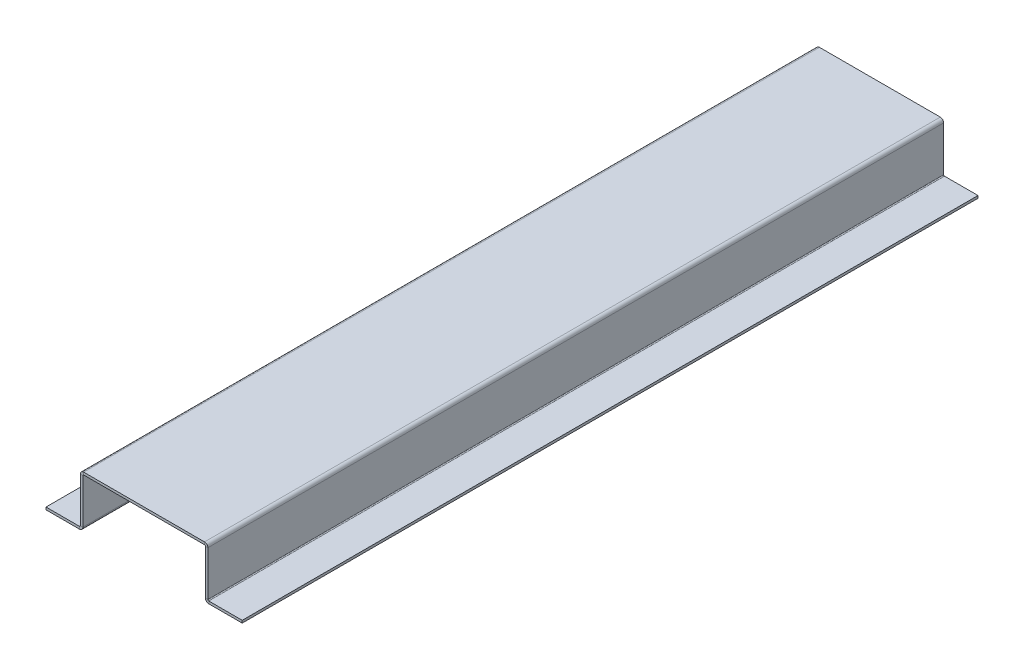
ISO-10303-21;
HEADER;
FILE_DESCRIPTION(('STEP AP214'),'2;1');
FILE_NAME('part.step','',(''),(''),'','','');
FILE_SCHEMA(('AUTOMOTIVE_DESIGN { 1 0 10303 214 1 1 1 1 }'));
ENDSEC;
DATA;
#1=APPLICATION_CONTEXT('core data for automotive mechanical design processes');
#2=APPLICATION_PROTOCOL_DEFINITION('international standard','automotive_design',2000,#1);
#3=PRODUCT_CONTEXT('',#1,'mechanical');
#4=PRODUCT('Part','Part','',(#3));
#5=PRODUCT_RELATED_PRODUCT_CATEGORY('part','',(#4));
#6=PRODUCT_DEFINITION_FORMATION('','',#4);
#7=PRODUCT_DEFINITION_CONTEXT('part definition',#1,'design');
#8=PRODUCT_DEFINITION('design','',#6,#7);
#9=PRODUCT_DEFINITION_SHAPE('','',#8);
#10=(LENGTH_UNIT() NAMED_UNIT(*) SI_UNIT(.MILLI.,.METRE.));
#11=(NAMED_UNIT(*) PLANE_ANGLE_UNIT() SI_UNIT($,.RADIAN.));
#12=(NAMED_UNIT(*) SI_UNIT($,.STERADIAN.) SOLID_ANGLE_UNIT());
#13=UNCERTAINTY_MEASURE_WITH_UNIT(LENGTH_MEASURE(1.E-05),#10,'distance_accuracy_value','');
#14=(GEOMETRIC_REPRESENTATION_CONTEXT(3) GLOBAL_UNCERTAINTY_ASSIGNED_CONTEXT((#13)) GLOBAL_UNIT_ASSIGNED_CONTEXT((#10,
#11,#12)) REPRESENTATION_CONTEXT('',''));
#15=CARTESIAN_POINT('',(0.,0.,0.));
#16=DIRECTION('',(0.,0.,1.));
#17=DIRECTION('',(1.,0.,0.));
#18=AXIS2_PLACEMENT_3D('',#15,#16,#17);
#19=CARTESIAN_POINT('',(52.7366,-40.,-300.));
#20=DIRECTION('',(0.,0.,-1.));
#21=DIRECTION('',(-1.,0.,0.));
#22=AXIS2_PLACEMENT_3D('',#19,#20,#21);
#23=PLANE('',#22);
#24=DIRECTION('',(0.,1.,0.));
#25=VECTOR('',#24,1.);
#26=CARTESIAN_POINT('',(52.7366,-40.,-300.));
#27=LINE('',#26,#25);
#28=CARTESIAN_POINT('',(52.7366,-40.,-300.));
#29=VERTEX_POINT('',#28);
#30=CARTESIAN_POINT('',(52.7366,-38.,-300.));
#31=VERTEX_POINT('',#30);
#32=EDGE_CURVE('E11',#29,#31,#27,.T.);
#33=ORIENTED_EDGE('',*,*,#32,.F.);
#34=CARTESIAN_POINT('',(52.7366,-37.2634,-300.));
#35=DIRECTION('',(0.,0.,1.));
#36=DIRECTION('',(1.,0.,0.));
#37=AXIS2_PLACEMENT_3D('',#34,#35,#36);
#38=CIRCLE('',#37,2.7366);
#39=CARTESIAN_POINT('',(50.,-37.2634,-300.));
#40=VERTEX_POINT('',#39);
#41=EDGE_CURVE('E374',#29,#40,#38,.F.);
#42=ORIENTED_EDGE('',*,*,#41,.T.);
#43=DIRECTION('',(-1.,0.,0.));
#44=VECTOR('',#43,1.);
#45=CARTESIAN_POINT('',(52.,-37.2634,-300.));
#46=LINE('',#45,#44);
#47=CARTESIAN_POINT('',(52.,-37.2634,-300.));
#48=VERTEX_POINT('',#47);
#49=EDGE_CURVE('E51',#48,#40,#46,.T.);
#50=ORIENTED_EDGE('',*,*,#49,.F.);
#51=CARTESIAN_POINT('',(52.7366,-37.2634,-300.));
#52=DIRECTION('',(0.,0.,1.));
#53=DIRECTION('',(1.,0.,0.));
#54=AXIS2_PLACEMENT_3D('',#51,#52,#53);
#55=CIRCLE('',#54,0.7366);
#56=EDGE_CURVE('E399',#31,#48,#55,.F.);
#57=ORIENTED_EDGE('',*,*,#56,.F.);
#58=EDGE_LOOP('',(#33,#42,#50,#57));
#59=FACE_BOUND('',#58,.T.);
#60=ADVANCED_FACE('F43',(#59),#23,.T.);
#61=CARTESIAN_POINT('',(52.,-37.2634,-300.));
#62=DIRECTION('',(0.,0.,-1.));
#63=DIRECTION('',(-1.,0.,0.));
#64=AXIS2_PLACEMENT_3D('',#61,#62,#63);
#65=PLANE('',#64);
#66=DIRECTION('',(-1.,0.,0.));
#67=VECTOR('',#66,1.);
#68=CARTESIAN_POINT('',(50.,-40.,-300.));
#69=LINE('',#68,#67);
#70=CARTESIAN_POINT('',(80.,-40.,-300.));
#71=VERTEX_POINT('',#70);
#72=EDGE_CURVE('E378',#71,#29,#69,.T.);
#73=ORIENTED_EDGE('',*,*,#72,.T.);
#74=ORIENTED_EDGE('',*,*,#32,.T.);
#75=DIRECTION('',(-1.,0.,0.));
#76=VECTOR('',#75,1.);
#77=CARTESIAN_POINT('',(50.,-38.,-300.));
#78=LINE('',#77,#76);
#79=CARTESIAN_POINT('',(80.,-38.,-300.));
#80=VERTEX_POINT('',#79);
#81=EDGE_CURVE('E396',#80,#31,#78,.T.);
#82=ORIENTED_EDGE('',*,*,#81,.F.);
#83=DIRECTION('',(0.,-1.,0.));
#84=VECTOR('',#83,1.);
#85=CARTESIAN_POINT('',(80.,-38.,-300.));
#86=LINE('',#85,#84);
#87=EDGE_CURVE('E394',#80,#71,#86,.T.);
#88=ORIENTED_EDGE('',*,*,#87,.T.);
#89=EDGE_LOOP('',(#73,#74,#82,#88));
#90=FACE_BOUND('',#89,.T.);
#91=ADVANCED_FACE('F424',(#90),#65,.T.);
#92=CARTESIAN_POINT('',(50.,-37.2634,300.));
#93=DIRECTION('',(0.,0.,1.));
#94=DIRECTION('',(1.,0.,0.));
#95=AXIS2_PLACEMENT_3D('',#92,#93,#94);
#96=PLANE('',#95);
#97=DIRECTION('',(1.,0.,0.));
#98=VECTOR('',#97,1.);
#99=CARTESIAN_POINT('',(50.,-37.2634,300.));
#100=LINE('',#99,#98);
#101=CARTESIAN_POINT('',(50.,-37.2634,300.));
#102=VERTEX_POINT('',#101);
#103=CARTESIAN_POINT('',(52.,-37.2634,300.));
#104=VERTEX_POINT('',#103);
#105=EDGE_CURVE('E358',#102,#104,#100,.T.);
#106=ORIENTED_EDGE('',*,*,#105,.F.);
#107=CARTESIAN_POINT('',(52.7366,-37.2634,300.));
#108=DIRECTION('',(0.,0.,1.));
#109=DIRECTION('',(1.,0.,0.));
#110=AXIS2_PLACEMENT_3D('',#107,#108,#109);
#111=CIRCLE('',#110,2.7366);
#112=CARTESIAN_POINT('',(52.7366,-40.,300.));
#113=VERTEX_POINT('',#112);
#114=EDGE_CURVE('E262',#113,#102,#111,.F.);
#115=ORIENTED_EDGE('',*,*,#114,.F.);
#116=DIRECTION('',(0.,-1.,0.));
#117=VECTOR('',#116,1.);
#118=CARTESIAN_POINT('',(52.7366,-38.,300.));
#119=LINE('',#118,#117);
#120=CARTESIAN_POINT('',(52.7366,-38.,300.));
#121=VERTEX_POINT('',#120);
#122=EDGE_CURVE('E356',#121,#113,#119,.T.);
#123=ORIENTED_EDGE('',*,*,#122,.F.);
#124=CARTESIAN_POINT('',(52.7366,-37.2634,300.));
#125=DIRECTION('',(0.,0.,1.));
#126=DIRECTION('',(1.,0.,0.));
#127=AXIS2_PLACEMENT_3D('',#124,#125,#126);
#128=CIRCLE('',#127,0.7366);
#129=EDGE_CURVE('E273',#121,#104,#128,.F.);
#130=ORIENTED_EDGE('',*,*,#129,.T.);
#131=EDGE_LOOP('',(#106,#115,#123,#130));
#132=FACE_BOUND('',#131,.T.);
#133=ADVANCED_FACE('F432',(#132),#96,.T.);
#134=CARTESIAN_POINT('',(52.7366,-38.,300.));
#135=DIRECTION('',(0.,0.,1.));
#136=DIRECTION('',(1.,0.,0.));
#137=AXIS2_PLACEMENT_3D('',#134,#135,#136);
#138=PLANE('',#137);
#139=DIRECTION('',(0.,1.,0.));
#140=VECTOR('',#139,1.);
#141=CARTESIAN_POINT('',(50.,0.,300.));
#142=LINE('',#141,#140);
#143=CARTESIAN_POINT('',(50.,-0.736599999999982,300.));
#144=VERTEX_POINT('',#143);
#145=EDGE_CURVE('E259',#102,#144,#142,.T.);
#146=ORIENTED_EDGE('',*,*,#145,.F.);
#147=ORIENTED_EDGE('',*,*,#105,.T.);
#148=DIRECTION('',(0.,1.,0.));
#149=VECTOR('',#148,1.);
#150=CARTESIAN_POINT('',(52.,0.,300.));
#151=LINE('',#150,#149);
#152=CARTESIAN_POINT('',(52.,-0.736599999999981,300.));
#153=VERTEX_POINT('',#152);
#154=EDGE_CURVE('E276',#104,#153,#151,.T.);
#155=ORIENTED_EDGE('',*,*,#154,.T.);
#156=DIRECTION('',(-1.,0.,0.));
#157=VECTOR('',#156,1.);
#158=CARTESIAN_POINT('',(52.,-0.736599999999981,300.));
#159=LINE('',#158,#157);
#160=EDGE_CURVE('E348',#153,#144,#159,.T.);
#161=ORIENTED_EDGE('',*,*,#160,.T.);
#162=EDGE_LOOP('',(#146,#147,#155,#161));
#163=FACE_BOUND('',#162,.T.);
#164=ADVANCED_FACE('F434',(#163),#138,.T.);
#165=CARTESIAN_POINT('',(50.,-0.736599999999982,-300.));
#166=DIRECTION('',(0.,0.,-1.));
#167=DIRECTION('',(-1.,0.,0.));
#168=AXIS2_PLACEMENT_3D('',#165,#166,#167);
#169=PLANE('',#168);
#170=DIRECTION('',(1.,0.,0.));
#171=VECTOR('',#170,1.);
#172=CARTESIAN_POINT('',(50.,-0.736599999999982,-300.));
#173=LINE('',#172,#171);
#174=CARTESIAN_POINT('',(50.,-0.736599999999982,-300.));
#175=VERTEX_POINT('',#174);
#176=CARTESIAN_POINT('',(52.,-0.736599999999981,-300.));
#177=VERTEX_POINT('',#176);
#178=EDGE_CURVE('E354',#175,#177,#173,.T.);
#179=ORIENTED_EDGE('',*,*,#178,.F.);
#180=CARTESIAN_POINT('',(49.2634,-0.736599999999982,-300.));
#181=DIRECTION('',(0.,0.,-1.));
#182=DIRECTION('',(-1.,0.,0.));
#183=AXIS2_PLACEMENT_3D('',#180,#181,#182);
#184=CIRCLE('',#183,0.7366);
#185=CARTESIAN_POINT('',(49.2634,0.,-300.));
#186=VERTEX_POINT('',#185);
#187=EDGE_CURVE('E386',#175,#186,#184,.F.);
#188=ORIENTED_EDGE('',*,*,#187,.T.);
#189=DIRECTION('',(0.,-1.,0.));
#190=VECTOR('',#189,1.);
#191=CARTESIAN_POINT('',(49.2634,2.00000000000002,-300.));
#192=LINE('',#191,#190);
#193=CARTESIAN_POINT('',(49.2634,2.00000000000002,-300.));
#194=VERTEX_POINT('',#193);
#195=EDGE_CURVE('E352',#194,#186,#192,.T.);
#196=ORIENTED_EDGE('',*,*,#195,.F.);
#197=CARTESIAN_POINT('',(49.2634,-0.736599999999982,-300.));
#198=DIRECTION('',(0.,0.,1.));
#199=DIRECTION('',(1.,0.,0.));
#200=AXIS2_PLACEMENT_3D('',#197,#198,#199);
#201=CIRCLE('',#200,2.7366);
#202=EDGE_CURVE('E230',#177,#194,#201,.T.);
#203=ORIENTED_EDGE('',*,*,#202,.F.);
#204=EDGE_LOOP('',(#179,#188,#196,#203));
#205=FACE_BOUND('',#204,.T.);
#206=ADVANCED_FACE('F410',(#205),#169,.T.);
#207=CARTESIAN_POINT('',(49.2634,2.00000000000002,-300.));
#208=DIRECTION('',(0.,0.,-1.));
#209=DIRECTION('',(-1.,0.,0.));
#210=AXIS2_PLACEMENT_3D('',#207,#208,#209);
#211=PLANE('',#210);
#212=DIRECTION('',(0.,1.,0.));
#213=VECTOR('',#212,1.);
#214=CARTESIAN_POINT('',(50.,0.,-300.));
#215=LINE('',#214,#213);
#216=EDGE_CURVE('E365',#40,#175,#215,.T.);
#217=ORIENTED_EDGE('',*,*,#216,.T.);
#218=ORIENTED_EDGE('',*,*,#178,.T.);
#219=DIRECTION('',(0.,1.,0.));
#220=VECTOR('',#219,1.);
#221=CARTESIAN_POINT('',(52.,0.,-300.));
#222=LINE('',#221,#220);
#223=EDGE_CURVE('E368',#48,#177,#222,.T.);
#224=ORIENTED_EDGE('',*,*,#223,.F.);
#225=ORIENTED_EDGE('',*,*,#49,.T.);
#226=EDGE_LOOP('',(#217,#218,#224,#225));
#227=FACE_BOUND('',#226,.T.);
#228=ADVANCED_FACE('F363',(#227),#211,.T.);
#229=CARTESIAN_POINT('',(49.2634,0.,300.));
#230=DIRECTION('',(0.,0.,1.));
#231=DIRECTION('',(1.,0.,0.));
#232=AXIS2_PLACEMENT_3D('',#229,#230,#231);
#233=PLANE('',#232);
#234=DIRECTION('',(0.,1.,0.));
#235=VECTOR('',#234,1.);
#236=CARTESIAN_POINT('',(49.2634,0.,300.));
#237=LINE('',#236,#235);
#238=CARTESIAN_POINT('',(49.2634,0.,300.));
#239=VERTEX_POINT('',#238);
#240=CARTESIAN_POINT('',(49.2634,2.00000000000002,300.));
#241=VERTEX_POINT('',#240);
#242=EDGE_CURVE('E350',#239,#241,#237,.T.);
#243=ORIENTED_EDGE('',*,*,#242,.F.);
#244=CARTESIAN_POINT('',(49.2634,-0.736599999999982,300.));
#245=DIRECTION('',(0.,0.,-1.));
#246=DIRECTION('',(-1.,0.,0.));
#247=AXIS2_PLACEMENT_3D('',#244,#245,#246);
#248=CIRCLE('',#247,0.7366);
#249=EDGE_CURVE('E256',#144,#239,#248,.F.);
#250=ORIENTED_EDGE('',*,*,#249,.F.);
#251=ORIENTED_EDGE('',*,*,#160,.F.);
#252=CARTESIAN_POINT('',(49.2634,-0.736599999999982,300.));
#253=DIRECTION('',(0.,0.,1.));
#254=DIRECTION('',(1.,0.,0.));
#255=AXIS2_PLACEMENT_3D('',#252,#253,#254);
#256=CIRCLE('',#255,2.7366);
#257=EDGE_CURVE('E279',#153,#241,#256,.T.);
#258=ORIENTED_EDGE('',*,*,#257,.T.);
#259=EDGE_LOOP('',(#243,#250,#251,#258));
#260=FACE_BOUND('',#259,.T.);
#261=ADVANCED_FACE('F440',(#260),#233,.T.);
#262=CARTESIAN_POINT('',(52.,-0.736599999999981,300.));
#263=DIRECTION('',(0.,0.,1.));
#264=DIRECTION('',(1.,0.,0.));
#265=AXIS2_PLACEMENT_3D('',#262,#263,#264);
#266=PLANE('',#265);
#267=DIRECTION('',(-1.,0.,0.));
#268=VECTOR('',#267,1.);
#269=CARTESIAN_POINT('',(-50.,0.,300.));
#270=LINE('',#269,#268);
#271=CARTESIAN_POINT('',(-49.2634,0.,300.));
#272=VERTEX_POINT('',#271);
#273=EDGE_CURVE('E253',#239,#272,#270,.T.);
#274=ORIENTED_EDGE('',*,*,#273,.F.);
#275=ORIENTED_EDGE('',*,*,#242,.T.);
#276=DIRECTION('',(-1.,0.,0.));
#277=VECTOR('',#276,1.);
#278=CARTESIAN_POINT('',(-50.,2.,300.));
#279=LINE('',#278,#277);
#280=CARTESIAN_POINT('',(-49.2634,2.,300.));
#281=VERTEX_POINT('',#280);
#282=EDGE_CURVE('E282',#241,#281,#279,.T.);
#283=ORIENTED_EDGE('',*,*,#282,.T.);
#284=DIRECTION('',(0.,-1.,0.));
#285=VECTOR('',#284,1.);
#286=CARTESIAN_POINT('',(-49.2634,2.,300.));
#287=LINE('',#286,#285);
#288=EDGE_CURVE('E344',#281,#272,#287,.T.);
#289=ORIENTED_EDGE('',*,*,#288,.T.);
#290=EDGE_LOOP('',(#274,#275,#283,#289));
#291=FACE_BOUND('',#290,.T.);
#292=ADVANCED_FACE('F443',(#291),#266,.T.);
#293=CARTESIAN_POINT('',(-49.2634,0.,-300.));
#294=DIRECTION('',(0.,0.,-1.));
#295=DIRECTION('',(-1.,0.,0.));
#296=AXIS2_PLACEMENT_3D('',#293,#294,#295);
#297=PLANE('',#296);
#298=DIRECTION('',(0.,1.,0.));
#299=VECTOR('',#298,1.);
#300=CARTESIAN_POINT('',(-49.2634,0.,-300.));
#301=LINE('',#300,#299);
#302=CARTESIAN_POINT('',(-49.2634,0.,-300.));
#303=VERTEX_POINT('',#302);
#304=CARTESIAN_POINT('',(-49.2634,2.,-300.));
#305=VERTEX_POINT('',#304);
#306=EDGE_CURVE('E202',#303,#305,#301,.T.);
#307=ORIENTED_EDGE('',*,*,#306,.F.);
#308=CARTESIAN_POINT('',(-49.2634,-0.7366,-300.));
#309=DIRECTION('',(0.,0.,-1.));
#310=DIRECTION('',(-1.,0.,0.));
#311=AXIS2_PLACEMENT_3D('',#308,#309,#310);
#312=CIRCLE('',#311,0.7366);
#313=CARTESIAN_POINT('',(-50.,-0.7366,-300.));
#314=VERTEX_POINT('',#313);
#315=EDGE_CURVE('E197',#303,#314,#312,.F.);
#316=ORIENTED_EDGE('',*,*,#315,.T.);
#317=DIRECTION('',(1.,0.,0.));
#318=VECTOR('',#317,1.);
#319=CARTESIAN_POINT('',(-52.,-0.736599999999999,-300.));
#320=LINE('',#319,#318);
#321=CARTESIAN_POINT('',(-52.,-0.736599999999999,-300.));
#322=VERTEX_POINT('',#321);
#323=EDGE_CURVE('E190',#322,#314,#320,.T.);
#324=ORIENTED_EDGE('',*,*,#323,.F.);
#325=CARTESIAN_POINT('',(-49.2634,-0.7366,-300.));
#326=DIRECTION('',(0.,0.,1.));
#327=DIRECTION('',(1.,0.,0.));
#328=AXIS2_PLACEMENT_3D('',#325,#326,#327);
#329=CIRCLE('',#328,2.7366);
#330=EDGE_CURVE('E194',#305,#322,#329,.T.);
#331=ORIENTED_EDGE('',*,*,#330,.F.);
#332=EDGE_LOOP('',(#307,#316,#324,#331));
#333=FACE_BOUND('',#332,.T.);
#334=ADVANCED_FACE('F192',(#333),#297,.T.);
#335=CARTESIAN_POINT('',(-52.,-0.736599999999999,-300.));
#336=DIRECTION('',(0.,0.,-1.));
#337=DIRECTION('',(-1.,0.,0.));
#338=AXIS2_PLACEMENT_3D('',#335,#336,#337);
#339=PLANE('',#338);
#340=DIRECTION('',(-1.,0.,0.));
#341=VECTOR('',#340,1.);
#342=CARTESIAN_POINT('',(-50.,0.,-300.));
#343=LINE('',#342,#341);
#344=EDGE_CURVE('E389',#186,#303,#343,.T.);
#345=ORIENTED_EDGE('',*,*,#344,.T.);
#346=ORIENTED_EDGE('',*,*,#306,.T.);
#347=DIRECTION('',(-1.,0.,0.));
#348=VECTOR('',#347,1.);
#349=CARTESIAN_POINT('',(-50.,2.,-300.));
#350=LINE('',#349,#348);
#351=EDGE_CURVE('E228',#194,#305,#350,.T.);
#352=ORIENTED_EDGE('',*,*,#351,.F.);
#353=ORIENTED_EDGE('',*,*,#195,.T.);
#354=EDGE_LOOP('',(#345,#346,#352,#353));
#355=FACE_BOUND('',#354,.T.);
#356=ADVANCED_FACE('F491',(#355),#339,.T.);
#357=CARTESIAN_POINT('',(-50.,-0.7366,300.));
#358=DIRECTION('',(0.,0.,1.));
#359=DIRECTION('',(1.,0.,0.));
#360=AXIS2_PLACEMENT_3D('',#357,#358,#359);
#361=PLANE('',#360);
#362=DIRECTION('',(-1.,0.,0.));
#363=VECTOR('',#362,1.);
#364=CARTESIAN_POINT('',(-50.,-0.7366,300.));
#365=LINE('',#364,#363);
#366=CARTESIAN_POINT('',(-50.,-0.7366,300.));
#367=VERTEX_POINT('',#366);
#368=CARTESIAN_POINT('',(-52.,-0.736599999999999,300.));
#369=VERTEX_POINT('',#368);
#370=EDGE_CURVE('E203',#367,#369,#365,.T.);
#371=ORIENTED_EDGE('',*,*,#370,.F.);
#372=CARTESIAN_POINT('',(-49.2634,-0.7366,300.));
#373=DIRECTION('',(0.,0.,-1.));
#374=DIRECTION('',(-1.,0.,0.));
#375=AXIS2_PLACEMENT_3D('',#372,#373,#374);
#376=CIRCLE('',#375,0.7366);
#377=EDGE_CURVE('E250',#272,#367,#376,.F.);
#378=ORIENTED_EDGE('',*,*,#377,.F.);
#379=ORIENTED_EDGE('',*,*,#288,.F.);
#380=CARTESIAN_POINT('',(-49.2634,-0.7366,300.));
#381=DIRECTION('',(0.,0.,1.));
#382=DIRECTION('',(1.,0.,0.));
#383=AXIS2_PLACEMENT_3D('',#380,#381,#382);
#384=CIRCLE('',#383,2.7366);
#385=EDGE_CURVE('E285',#281,#369,#384,.T.);
#386=ORIENTED_EDGE('',*,*,#385,.T.);
#387=EDGE_LOOP('',(#371,#378,#379,#386));
#388=FACE_BOUND('',#387,.T.);
#389=ADVANCED_FACE('F452',(#388),#361,.T.);
#390=CARTESIAN_POINT('',(-49.2634,2.,300.));
#391=DIRECTION('',(0.,0.,1.));
#392=DIRECTION('',(1.,0.,0.));
#393=AXIS2_PLACEMENT_3D('',#390,#391,#392);
#394=PLANE('',#393);
#395=DIRECTION('',(0.,-1.,0.));
#396=VECTOR('',#395,1.);
#397=CARTESIAN_POINT('',(-50.,0.,300.));
#398=LINE('',#397,#396);
#399=CARTESIAN_POINT('',(-50.,-37.2634,300.));
#400=VERTEX_POINT('',#399);
#401=EDGE_CURVE('E247',#367,#400,#398,.T.);
#402=ORIENTED_EDGE('',*,*,#401,.F.);
#403=ORIENTED_EDGE('',*,*,#370,.T.);
#404=DIRECTION('',(0.,-1.,0.));
#405=VECTOR('',#404,1.);
#406=CARTESIAN_POINT('',(-52.,0.,300.));
#407=LINE('',#406,#405);
#408=CARTESIAN_POINT('',(-52.,-37.2634,300.));
#409=VERTEX_POINT('',#408);
#410=EDGE_CURVE('E213',#369,#409,#407,.T.);
#411=ORIENTED_EDGE('',*,*,#410,.T.);
#412=DIRECTION('',(1.,0.,0.));
#413=VECTOR('',#412,1.);
#414=CARTESIAN_POINT('',(-52.,-37.2634,300.));
#415=LINE('',#414,#413);
#416=EDGE_CURVE('E124',#409,#400,#415,.T.);
#417=ORIENTED_EDGE('',*,*,#416,.T.);
#418=EDGE_LOOP('',(#402,#403,#411,#417));
#419=FACE_BOUND('',#418,.T.);
#420=ADVANCED_FACE('F455',(#419),#394,.T.);
#421=CARTESIAN_POINT('',(-50.,-37.2634,-300.));
#422=DIRECTION('',(0.,0.,-1.));
#423=DIRECTION('',(-1.,0.,0.));
#424=AXIS2_PLACEMENT_3D('',#421,#422,#423);
#425=PLANE('',#424);
#426=DIRECTION('',(-1.,0.,0.));
#427=VECTOR('',#426,1.);
#428=CARTESIAN_POINT('',(-50.,-37.2634,-300.));
#429=LINE('',#428,#427);
#430=CARTESIAN_POINT('',(-50.,-37.2634,-300.));
#431=VERTEX_POINT('',#430);
#432=CARTESIAN_POINT('',(-52.,-37.2634,-300.));
#433=VERTEX_POINT('',#432);
#434=EDGE_CURVE('E221',#431,#433,#429,.T.);
#435=ORIENTED_EDGE('',*,*,#434,.F.);
#436=CARTESIAN_POINT('',(-52.7366,-37.2634,-300.));
#437=DIRECTION('',(0.,0.,1.));
#438=DIRECTION('',(1.,0.,0.));
#439=AXIS2_PLACEMENT_3D('',#436,#437,#438);
#440=CIRCLE('',#439,2.7366);
#441=CARTESIAN_POINT('',(-52.7366,-40.,-300.));
#442=VERTEX_POINT('',#441);
#443=EDGE_CURVE('E465',#431,#442,#440,.F.);
#444=ORIENTED_EDGE('',*,*,#443,.T.);
#445=DIRECTION('',(0.,-1.,0.));
#446=VECTOR('',#445,1.);
#447=CARTESIAN_POINT('',(-52.7366,-38.,-300.));
#448=LINE('',#447,#446);
#449=CARTESIAN_POINT('',(-52.7366,-38.,-300.));
#450=VERTEX_POINT('',#449);
#451=EDGE_CURVE('E59',#450,#442,#448,.T.);
#452=ORIENTED_EDGE('',*,*,#451,.F.);
#453=CARTESIAN_POINT('',(-52.7366,-37.2634,-300.));
#454=DIRECTION('',(0.,0.,1.));
#455=DIRECTION('',(1.,0.,0.));
#456=AXIS2_PLACEMENT_3D('',#453,#454,#455);
#457=CIRCLE('',#456,0.7366);
#458=EDGE_CURVE('E223',#433,#450,#457,.F.);
#459=ORIENTED_EDGE('',*,*,#458,.F.);
#460=EDGE_LOOP('',(#435,#444,#452,#459));
#461=FACE_BOUND('',#460,.T.);
#462=ADVANCED_FACE('F530',(#461),#425,.T.);
#463=CARTESIAN_POINT('',(-52.7366,-38.,-300.));
#464=DIRECTION('',(0.,0.,-1.));
#465=DIRECTION('',(-1.,0.,0.));
#466=AXIS2_PLACEMENT_3D('',#463,#464,#465);
#467=PLANE('',#466);
#468=DIRECTION('',(0.,-1.,0.));
#469=VECTOR('',#468,1.);
#470=CARTESIAN_POINT('',(-50.,0.,-300.));
#471=LINE('',#470,#469);
#472=EDGE_CURVE('E483',#314,#431,#471,.T.);
#473=ORIENTED_EDGE('',*,*,#472,.T.);
#474=ORIENTED_EDGE('',*,*,#434,.T.);
#475=DIRECTION('',(0.,-1.,0.));
#476=VECTOR('',#475,1.);
#477=CARTESIAN_POINT('',(-52.,0.,-300.));
#478=LINE('',#477,#476);
#479=EDGE_CURVE('E211',#322,#433,#478,.T.);
#480=ORIENTED_EDGE('',*,*,#479,.F.);
#481=ORIENTED_EDGE('',*,*,#323,.T.);
#482=EDGE_LOOP('',(#473,#474,#480,#481));
#483=FACE_BOUND('',#482,.T.);
#484=ADVANCED_FACE('F220',(#483),#467,.T.);
#485=CARTESIAN_POINT('',(-52.7366,-40.,300.));
#486=DIRECTION('',(0.,0.,1.));
#487=DIRECTION('',(1.,0.,0.));
#488=AXIS2_PLACEMENT_3D('',#485,#486,#487);
#489=PLANE('',#488);
#490=DIRECTION('',(0.,1.,0.));
#491=VECTOR('',#490,1.);
#492=CARTESIAN_POINT('',(-52.7366,-40.,300.));
#493=LINE('',#492,#491);
#494=CARTESIAN_POINT('',(-52.7366,-40.,300.));
#495=VERTEX_POINT('',#494);
#496=CARTESIAN_POINT('',(-52.7366,-38.,300.));
#497=VERTEX_POINT('',#496);
#498=EDGE_CURVE('E131',#495,#497,#493,.T.);
#499=ORIENTED_EDGE('',*,*,#498,.F.);
#500=CARTESIAN_POINT('',(-52.7366,-37.2634,300.));
#501=DIRECTION('',(0.,0.,1.));
#502=DIRECTION('',(1.,0.,0.));
#503=AXIS2_PLACEMENT_3D('',#500,#501,#502);
#504=CIRCLE('',#503,2.7366);
#505=EDGE_CURVE('E244',#400,#495,#504,.F.);
#506=ORIENTED_EDGE('',*,*,#505,.F.);
#507=ORIENTED_EDGE('',*,*,#416,.F.);
#508=CARTESIAN_POINT('',(-52.7366,-37.2634,300.));
#509=DIRECTION('',(0.,0.,1.));
#510=DIRECTION('',(1.,0.,0.));
#511=AXIS2_PLACEMENT_3D('',#508,#509,#510);
#512=CIRCLE('',#511,0.7366);
#513=EDGE_CURVE('E288',#409,#497,#512,.F.);
#514=ORIENTED_EDGE('',*,*,#513,.T.);
#515=EDGE_LOOP('',(#499,#506,#507,#514));
#516=FACE_BOUND('',#515,.T.);
#517=ADVANCED_FACE('F466',(#516),#489,.T.);
#518=CARTESIAN_POINT('',(-52.,-37.2634,300.));
#519=DIRECTION('',(0.,0.,1.));
#520=DIRECTION('',(1.,0.,0.));
#521=AXIS2_PLACEMENT_3D('',#518,#519,#520);
#522=PLANE('',#521);
#523=DIRECTION('',(-1.,0.,0.));
#524=VECTOR('',#523,1.);
#525=CARTESIAN_POINT('',(-50.,-40.,300.));
#526=LINE('',#525,#524);
#527=CARTESIAN_POINT('',(-80.,-40.,300.));
#528=VERTEX_POINT('',#527);
#529=EDGE_CURVE('E242',#495,#528,#526,.T.);
#530=ORIENTED_EDGE('',*,*,#529,.F.);
#531=ORIENTED_EDGE('',*,*,#498,.T.);
#532=DIRECTION('',(-1.,0.,0.));
#533=VECTOR('',#532,1.);
#534=CARTESIAN_POINT('',(-50.,-38.,300.));
#535=LINE('',#534,#533);
#536=CARTESIAN_POINT('',(-80.,-38.,300.));
#537=VERTEX_POINT('',#536);
#538=EDGE_CURVE('E237',#497,#537,#535,.T.);
#539=ORIENTED_EDGE('',*,*,#538,.T.);
#540=DIRECTION('',(0.,1.,0.));
#541=VECTOR('',#540,1.);
#542=CARTESIAN_POINT('',(-80.,-40.,300.));
#543=LINE('',#542,#541);
#544=EDGE_CURVE('E239',#528,#537,#543,.T.);
#545=ORIENTED_EDGE('',*,*,#544,.F.);
#546=EDGE_LOOP('',(#530,#531,#539,#545));
#547=FACE_BOUND('',#546,.T.);
#548=ADVANCED_FACE('F474',(#547),#522,.T.);
#549=CARTESIAN_POINT('',(-50.,-38.,-300.));
#550=DIRECTION('',(0.,1.,0.));
#551=DIRECTION('',(-1.,0.,0.));
#552=AXIS2_PLACEMENT_3D('',#549,#550,#551);
#553=PLANE('',#552);
#554=ORIENTED_EDGE('',*,*,#538,.F.);
#555=DIRECTION('',(0.,0.,1.));
#556=VECTOR('',#555,1.);
#557=CARTESIAN_POINT('',(-52.7366,-38.,-300.));
#558=LINE('',#557,#556);
#559=EDGE_CURVE('E291',#450,#497,#558,.T.);
#560=ORIENTED_EDGE('',*,*,#559,.F.);
#561=DIRECTION('',(-1.,0.,0.));
#562=VECTOR('',#561,1.);
#563=CARTESIAN_POINT('',(-50.,-38.,-300.));
#564=LINE('',#563,#562);
#565=CARTESIAN_POINT('',(-80.,-38.,-300.));
#566=VERTEX_POINT('',#565);
#567=EDGE_CURVE('E290',#450,#566,#564,.T.);
#568=ORIENTED_EDGE('',*,*,#567,.T.);
#569=DIRECTION('',(0.,0.,1.));
#570=VECTOR('',#569,1.);
#571=CARTESIAN_POINT('',(-80.,-38.,-300.));
#572=LINE('',#571,#570);
#573=EDGE_CURVE('E236',#566,#537,#572,.T.);
#574=ORIENTED_EDGE('',*,*,#573,.T.);
#575=EDGE_LOOP('',(#554,#560,#568,#574));
#576=FACE_BOUND('',#575,.T.);
#577=ADVANCED_FACE('F472',(#576),#553,.T.);
#578=CARTESIAN_POINT('',(-52.7366,-37.2634,-300.));
#579=DIRECTION('',(0.,0.,1.));
#580=DIRECTION('',(1.,0.,0.));
#581=AXIS2_PLACEMENT_3D('',#578,#579,#580);
#582=CYLINDRICAL_SURFACE('',#581,0.7366);
#583=ORIENTED_EDGE('',*,*,#513,.F.);
#584=DIRECTION('',(0.,0.,1.));
#585=VECTOR('',#584,1.);
#586=CARTESIAN_POINT('',(-52.,-37.2634,-300.));
#587=LINE('',#586,#585);
#588=EDGE_CURVE('E217',#433,#409,#587,.T.);
#589=ORIENTED_EDGE('',*,*,#588,.F.);
#590=ORIENTED_EDGE('',*,*,#458,.T.);
#591=ORIENTED_EDGE('',*,*,#559,.T.);
#592=EDGE_LOOP('',(#583,#589,#590,#591));
#593=FACE_BOUND('',#592,.T.);
#594=ADVANCED_FACE('F468',(#593),#582,.F.);
#595=CARTESIAN_POINT('',(-52.,0.,-300.));
#596=DIRECTION('',(-1.,0.,0.));
#597=DIRECTION('',(0.,-1.,0.));
#598=AXIS2_PLACEMENT_3D('',#595,#596,#597);
#599=PLANE('',#598);
#600=ORIENTED_EDGE('',*,*,#410,.F.);
#601=DIRECTION('',(0.,0.,1.));
#602=VECTOR('',#601,1.);
#603=CARTESIAN_POINT('',(-52.,-0.736599999999999,-300.));
#604=LINE('',#603,#602);
#605=EDGE_CURVE('E209',#322,#369,#604,.T.);
#606=ORIENTED_EDGE('',*,*,#605,.F.);
#607=ORIENTED_EDGE('',*,*,#479,.T.);
#608=ORIENTED_EDGE('',*,*,#588,.T.);
#609=EDGE_LOOP('',(#600,#606,#607,#608));
#610=FACE_BOUND('',#609,.T.);
#611=ADVANCED_FACE('F210',(#610),#599,.T.);
#612=CARTESIAN_POINT('',(-49.2634,-0.7366,-300.));
#613=DIRECTION('',(0.,0.,1.));
#614=DIRECTION('',(1.,0.,0.));
#615=AXIS2_PLACEMENT_3D('',#612,#613,#614);
#616=CYLINDRICAL_SURFACE('',#615,2.7366);
#617=ORIENTED_EDGE('',*,*,#385,.F.);
#618=DIRECTION('',(0.,0.,1.));
#619=VECTOR('',#618,1.);
#620=CARTESIAN_POINT('',(-49.2634,2.,-300.));
#621=LINE('',#620,#619);
#622=EDGE_CURVE('E218',#305,#281,#621,.T.);
#623=ORIENTED_EDGE('',*,*,#622,.F.);
#624=ORIENTED_EDGE('',*,*,#330,.T.);
#625=ORIENTED_EDGE('',*,*,#605,.T.);
#626=EDGE_LOOP('',(#617,#623,#624,#625));
#627=FACE_BOUND('',#626,.T.);
#628=ADVANCED_FACE('F226',(#627),#616,.T.);
#629=CARTESIAN_POINT('',(-50.,2.,-300.));
#630=DIRECTION('',(0.,1.,0.));
#631=DIRECTION('',(-1.,0.,0.));
#632=AXIS2_PLACEMENT_3D('',#629,#630,#631);
#633=PLANE('',#632);
#634=ORIENTED_EDGE('',*,*,#282,.F.);
#635=DIRECTION('',(0.,0.,1.));
#636=VECTOR('',#635,1.);
#637=CARTESIAN_POINT('',(49.2634,2.00000000000002,-300.));
#638=LINE('',#637,#636);
#639=EDGE_CURVE('E295',#194,#241,#638,.T.);
#640=ORIENTED_EDGE('',*,*,#639,.F.);
#641=ORIENTED_EDGE('',*,*,#351,.T.);
#642=ORIENTED_EDGE('',*,*,#622,.T.);
#643=EDGE_LOOP('',(#634,#640,#641,#642));
#644=FACE_BOUND('',#643,.T.);
#645=ADVANCED_FACE('F494',(#644),#633,.T.);
#646=CARTESIAN_POINT('',(49.2634,-0.736599999999982,-300.));
#647=DIRECTION('',(0.,0.,1.));
#648=DIRECTION('',(1.,0.,0.));
#649=AXIS2_PLACEMENT_3D('',#646,#647,#648);
#650=CYLINDRICAL_SURFACE('',#649,2.7366);
#651=ORIENTED_EDGE('',*,*,#257,.F.);
#652=DIRECTION('',(0.,0.,1.));
#653=VECTOR('',#652,1.);
#654=CARTESIAN_POINT('',(52.,-0.736599999999981,-300.));
#655=LINE('',#654,#653);
#656=EDGE_CURVE('E298',#177,#153,#655,.T.);
#657=ORIENTED_EDGE('',*,*,#656,.F.);
#658=ORIENTED_EDGE('',*,*,#202,.T.);
#659=ORIENTED_EDGE('',*,*,#639,.T.);
#660=EDGE_LOOP('',(#651,#657,#658,#659));
#661=FACE_BOUND('',#660,.T.);
#662=ADVANCED_FACE('F406',(#661),#650,.T.);
#663=CARTESIAN_POINT('',(52.,0.,-300.));
#664=DIRECTION('',(1.,0.,0.));
#665=DIRECTION('',(0.,1.,0.));
#666=AXIS2_PLACEMENT_3D('',#663,#664,#665);
#667=PLANE('',#666);
#668=ORIENTED_EDGE('',*,*,#154,.F.);
#669=DIRECTION('',(0.,0.,1.));
#670=VECTOR('',#669,1.);
#671=CARTESIAN_POINT('',(52.,-37.2634,-300.));
#672=LINE('',#671,#670);
#673=EDGE_CURVE('E301',#48,#104,#672,.T.);
#674=ORIENTED_EDGE('',*,*,#673,.F.);
#675=ORIENTED_EDGE('',*,*,#223,.T.);
#676=ORIENTED_EDGE('',*,*,#656,.T.);
#677=EDGE_LOOP('',(#668,#674,#675,#676));
#678=FACE_BOUND('',#677,.T.);
#679=ADVANCED_FACE('F413',(#678),#667,.T.);
#680=CARTESIAN_POINT('',(52.7366,-37.2634,-300.));
#681=DIRECTION('',(0.,0.,1.));
#682=DIRECTION('',(1.,0.,0.));
#683=AXIS2_PLACEMENT_3D('',#680,#681,#682);
#684=CYLINDRICAL_SURFACE('',#683,0.7366);
#685=ORIENTED_EDGE('',*,*,#129,.F.);
#686=DIRECTION('',(0.,0.,1.));
#687=VECTOR('',#686,1.);
#688=CARTESIAN_POINT('',(52.7366,-38.,-300.));
#689=LINE('',#688,#687);
#690=EDGE_CURVE('E304',#31,#121,#689,.T.);
#691=ORIENTED_EDGE('',*,*,#690,.F.);
#692=ORIENTED_EDGE('',*,*,#56,.T.);
#693=ORIENTED_EDGE('',*,*,#673,.T.);
#694=EDGE_LOOP('',(#685,#691,#692,#693));
#695=FACE_BOUND('',#694,.T.);
#696=ADVANCED_FACE('F416',(#695),#684,.F.);
#697=CARTESIAN_POINT('',(50.,-38.,-300.));
#698=DIRECTION('',(0.,1.,0.));
#699=DIRECTION('',(-1.,0.,0.));
#700=AXIS2_PLACEMENT_3D('',#697,#698,#699);
#701=PLANE('',#700);
#702=DIRECTION('',(-1.,0.,0.));
#703=VECTOR('',#702,1.);
#704=CARTESIAN_POINT('',(50.,-38.,300.));
#705=LINE('',#704,#703);
#706=CARTESIAN_POINT('',(80.,-38.,300.));
#707=VERTEX_POINT('',#706);
#708=EDGE_CURVE('E270',#707,#121,#705,.T.);
#709=ORIENTED_EDGE('',*,*,#708,.F.);
#710=DIRECTION('',(0.,0.,1.));
#711=VECTOR('',#710,1.);
#712=CARTESIAN_POINT('',(80.,-38.,-300.));
#713=LINE('',#712,#711);
#714=EDGE_CURVE('E307',#80,#707,#713,.T.);
#715=ORIENTED_EDGE('',*,*,#714,.F.);
#716=ORIENTED_EDGE('',*,*,#81,.T.);
#717=ORIENTED_EDGE('',*,*,#690,.T.);
#718=EDGE_LOOP('',(#709,#715,#716,#717));
#719=FACE_BOUND('',#718,.T.);
#720=ADVANCED_FACE('F421',(#719),#701,.T.);
#721=CARTESIAN_POINT('',(80.,-38.,-300.));
#722=DIRECTION('',(-1.,0.,0.));
#723=DIRECTION('',(0.,0.,1.));
#724=AXIS2_PLACEMENT_3D('',#721,#722,#723);
#725=PLANE('',#724);
#726=DIRECTION('',(0.,-1.,0.));
#727=VECTOR('',#726,1.);
#728=CARTESIAN_POINT('',(80.,-38.,300.));
#729=LINE('',#728,#727);
#730=CARTESIAN_POINT('',(80.,-40.,300.));
#731=VERTEX_POINT('',#730);
#732=EDGE_CURVE('E268',#707,#731,#729,.T.);
#733=ORIENTED_EDGE('',*,*,#732,.T.);
#734=DIRECTION('',(0.,0.,1.));
#735=VECTOR('',#734,1.);
#736=CARTESIAN_POINT('',(80.,-40.,-300.));
#737=LINE('',#736,#735);
#738=EDGE_CURVE('E309',#71,#731,#737,.T.);
#739=ORIENTED_EDGE('',*,*,#738,.F.);
#740=ORIENTED_EDGE('',*,*,#87,.F.);
#741=ORIENTED_EDGE('',*,*,#714,.T.);
#742=EDGE_LOOP('',(#733,#739,#740,#741));
#743=FACE_BOUND('',#742,.T.);
#744=ADVANCED_FACE('F562',(#743),#725,.F.);
#745=CARTESIAN_POINT('',(50.,-40.,-300.));
#746=DIRECTION('',(0.,1.,0.));
#747=DIRECTION('',(-1.,0.,0.));
#748=AXIS2_PLACEMENT_3D('',#745,#746,#747);
#749=PLANE('',#748);
#750=DIRECTION('',(-1.,0.,0.));
#751=VECTOR('',#750,1.);
#752=CARTESIAN_POINT('',(50.,-40.,300.));
#753=LINE('',#752,#751);
#754=EDGE_CURVE('E265',#731,#113,#753,.T.);
#755=ORIENTED_EDGE('',*,*,#754,.T.);
#756=DIRECTION('',(0.,0.,1.));
#757=VECTOR('',#756,1.);
#758=CARTESIAN_POINT('',(52.7366,-40.,-300.));
#759=LINE('',#758,#757);
#760=EDGE_CURVE('E312',#29,#113,#759,.T.);
#761=ORIENTED_EDGE('',*,*,#760,.F.);
#762=ORIENTED_EDGE('',*,*,#72,.F.);
#763=ORIENTED_EDGE('',*,*,#738,.T.);
#764=EDGE_LOOP('',(#755,#761,#762,#763));
#765=FACE_BOUND('',#764,.T.);
#766=ADVANCED_FACE('F429',(#765),#749,.F.);
#767=CARTESIAN_POINT('',(52.7366,-37.2634,-300.));
#768=DIRECTION('',(0.,0.,1.));
#769=DIRECTION('',(1.,0.,0.));
#770=AXIS2_PLACEMENT_3D('',#767,#768,#769);
#771=CYLINDRICAL_SURFACE('',#770,2.7366);
#772=ORIENTED_EDGE('',*,*,#114,.T.);
#773=DIRECTION('',(0.,0.,1.));
#774=VECTOR('',#773,1.);
#775=CARTESIAN_POINT('',(50.,-37.2634,-300.));
#776=LINE('',#775,#774);
#777=EDGE_CURVE('E315',#40,#102,#776,.T.);
#778=ORIENTED_EDGE('',*,*,#777,.F.);
#779=ORIENTED_EDGE('',*,*,#41,.F.);
#780=ORIENTED_EDGE('',*,*,#760,.T.);
#781=EDGE_LOOP('',(#772,#778,#779,#780));
#782=FACE_BOUND('',#781,.T.);
#783=ADVANCED_FACE('F380',(#782),#771,.T.);
#784=CARTESIAN_POINT('',(50.,0.,-300.));
#785=DIRECTION('',(1.,0.,0.));
#786=DIRECTION('',(0.,1.,0.));
#787=AXIS2_PLACEMENT_3D('',#784,#785,#786);
#788=PLANE('',#787);
#789=ORIENTED_EDGE('',*,*,#145,.T.);
#790=DIRECTION('',(0.,0.,1.));
#791=VECTOR('',#790,1.);
#792=CARTESIAN_POINT('',(50.,-0.736599999999982,-300.));
#793=LINE('',#792,#791);
#794=EDGE_CURVE('E318',#175,#144,#793,.T.);
#795=ORIENTED_EDGE('',*,*,#794,.F.);
#796=ORIENTED_EDGE('',*,*,#216,.F.);
#797=ORIENTED_EDGE('',*,*,#777,.T.);
#798=EDGE_LOOP('',(#789,#795,#796,#797));
#799=FACE_BOUND('',#798,.T.);
#800=ADVANCED_FACE('F384',(#799),#788,.F.);
#801=CARTESIAN_POINT('',(49.2634,-0.736599999999982,-300.));
#802=DIRECTION('',(0.,0.,1.));
#803=DIRECTION('',(1.,0.,0.));
#804=AXIS2_PLACEMENT_3D('',#801,#802,#803);
#805=CYLINDRICAL_SURFACE('',#804,0.7366);
#806=ORIENTED_EDGE('',*,*,#249,.T.);
#807=DIRECTION('',(0.,0.,1.));
#808=VECTOR('',#807,1.);
#809=CARTESIAN_POINT('',(49.2634,0.,-300.));
#810=LINE('',#809,#808);
#811=EDGE_CURVE('E321',#186,#239,#810,.T.);
#812=ORIENTED_EDGE('',*,*,#811,.F.);
#813=ORIENTED_EDGE('',*,*,#187,.F.);
#814=ORIENTED_EDGE('',*,*,#794,.T.);
#815=EDGE_LOOP('',(#806,#812,#813,#814));
#816=FACE_BOUND('',#815,.T.);
#817=ADVANCED_FACE('F437',(#816),#805,.F.);
#818=CARTESIAN_POINT('',(-50.,0.,-300.));
#819=DIRECTION('',(0.,1.,0.));
#820=DIRECTION('',(-1.,0.,0.));
#821=AXIS2_PLACEMENT_3D('',#818,#819,#820);
#822=PLANE('',#821);
#823=ORIENTED_EDGE('',*,*,#273,.T.);
#824=DIRECTION('',(0.,0.,1.));
#825=VECTOR('',#824,1.);
#826=CARTESIAN_POINT('',(-49.2634,0.,-300.));
#827=LINE('',#826,#825);
#828=EDGE_CURVE('E324',#303,#272,#827,.T.);
#829=ORIENTED_EDGE('',*,*,#828,.F.);
#830=ORIENTED_EDGE('',*,*,#344,.F.);
#831=ORIENTED_EDGE('',*,*,#811,.T.);
#832=EDGE_LOOP('',(#823,#829,#830,#831));
#833=FACE_BOUND('',#832,.T.);
#834=ADVANCED_FACE('F446',(#833),#822,.F.);
#835=CARTESIAN_POINT('',(-49.2634,-0.7366,-300.));
#836=DIRECTION('',(0.,0.,1.));
#837=DIRECTION('',(1.,0.,0.));
#838=AXIS2_PLACEMENT_3D('',#835,#836,#837);
#839=CYLINDRICAL_SURFACE('',#838,0.7366);
#840=ORIENTED_EDGE('',*,*,#377,.T.);
#841=DIRECTION('',(0.,0.,1.));
#842=VECTOR('',#841,1.);
#843=CARTESIAN_POINT('',(-50.,-0.7366,-300.));
#844=LINE('',#843,#842);
#845=EDGE_CURVE('E327',#314,#367,#844,.T.);
#846=ORIENTED_EDGE('',*,*,#845,.F.);
#847=ORIENTED_EDGE('',*,*,#315,.F.);
#848=ORIENTED_EDGE('',*,*,#828,.T.);
#849=EDGE_LOOP('',(#840,#846,#847,#848));
#850=FACE_BOUND('',#849,.T.);
#851=ADVANCED_FACE('F450',(#850),#839,.F.);
#852=CARTESIAN_POINT('',(-50.,0.,-300.));
#853=DIRECTION('',(-1.,0.,0.));
#854=DIRECTION('',(0.,-1.,0.));
#855=AXIS2_PLACEMENT_3D('',#852,#853,#854);
#856=PLANE('',#855);
#857=ORIENTED_EDGE('',*,*,#401,.T.);
#858=DIRECTION('',(0.,0.,1.));
#859=VECTOR('',#858,1.);
#860=CARTESIAN_POINT('',(-50.,-37.2634,-300.));
#861=LINE('',#860,#859);
#862=EDGE_CURVE('E330',#431,#400,#861,.T.);
#863=ORIENTED_EDGE('',*,*,#862,.F.);
#864=ORIENTED_EDGE('',*,*,#472,.F.);
#865=ORIENTED_EDGE('',*,*,#845,.T.);
#866=EDGE_LOOP('',(#857,#863,#864,#865));
#867=FACE_BOUND('',#866,.T.);
#868=ADVANCED_FACE('F459',(#867),#856,.F.);
#869=CARTESIAN_POINT('',(-52.7366,-37.2634,-300.));
#870=DIRECTION('',(0.,0.,1.));
#871=DIRECTION('',(1.,0.,0.));
#872=AXIS2_PLACEMENT_3D('',#869,#870,#871);
#873=CYLINDRICAL_SURFACE('',#872,2.7366);
#874=ORIENTED_EDGE('',*,*,#505,.T.);
#875=DIRECTION('',(0.,0.,1.));
#876=VECTOR('',#875,1.);
#877=CARTESIAN_POINT('',(-52.7366,-40.,-300.));
#878=LINE('',#877,#876);
#879=EDGE_CURVE('E333',#442,#495,#878,.T.);
#880=ORIENTED_EDGE('',*,*,#879,.F.);
#881=ORIENTED_EDGE('',*,*,#443,.F.);
#882=ORIENTED_EDGE('',*,*,#862,.T.);
#883=EDGE_LOOP('',(#874,#880,#881,#882));
#884=FACE_BOUND('',#883,.T.);
#885=ADVANCED_FACE('F463',(#884),#873,.T.);
#886=CARTESIAN_POINT('',(-50.,-40.,-300.));
#887=DIRECTION('',(0.,1.,0.));
#888=DIRECTION('',(-1.,0.,0.));
#889=AXIS2_PLACEMENT_3D('',#886,#887,#888);
#890=PLANE('',#889);
#891=ORIENTED_EDGE('',*,*,#529,.T.);
#892=DIRECTION('',(0.,0.,1.));
#893=VECTOR('',#892,1.);
#894=CARTESIAN_POINT('',(-80.,-40.,-300.));
#895=LINE('',#894,#893);
#896=CARTESIAN_POINT('',(-80.,-40.,-300.));
#897=VERTEX_POINT('',#896);
#898=EDGE_CURVE('E336',#897,#528,#895,.T.);
#899=ORIENTED_EDGE('',*,*,#898,.F.);
#900=DIRECTION('',(-1.,0.,0.));
#901=VECTOR('',#900,1.);
#902=CARTESIAN_POINT('',(-50.,-40.,-300.));
#903=LINE('',#902,#901);
#904=EDGE_CURVE('E481',#442,#897,#903,.T.);
#905=ORIENTED_EDGE('',*,*,#904,.F.);
#906=ORIENTED_EDGE('',*,*,#879,.T.);
#907=EDGE_LOOP('',(#891,#899,#905,#906));
#908=FACE_BOUND('',#907,.T.);
#909=ADVANCED_FACE('F480',(#908),#890,.F.);
#910=CARTESIAN_POINT('',(-80.,-40.,-300.));
#911=DIRECTION('',(1.,0.,0.));
#912=DIRECTION('',(0.,0.,-1.));
#913=AXIS2_PLACEMENT_3D('',#910,#911,#912);
#914=PLANE('',#913);
#915=ORIENTED_EDGE('',*,*,#544,.T.);
#916=ORIENTED_EDGE('',*,*,#573,.F.);
#917=DIRECTION('',(0.,1.,0.));
#918=VECTOR('',#917,1.);
#919=CARTESIAN_POINT('',(-80.,-40.,-300.));
#920=LINE('',#919,#918);
#921=EDGE_CURVE('E140',#897,#566,#920,.T.);
#922=ORIENTED_EDGE('',*,*,#921,.F.);
#923=ORIENTED_EDGE('',*,*,#898,.T.);
#924=EDGE_LOOP('',(#915,#916,#922,#923));
#925=FACE_BOUND('',#924,.T.);
#926=ADVANCED_FACE('F476',(#925),#914,.F.);
#927=CARTESIAN_POINT('',(-52.7366,-37.2634,-300.));
#928=DIRECTION('',(0.,0.,1.));
#929=DIRECTION('',(1.,0.,0.));
#930=AXIS2_PLACEMENT_3D('',#927,#928,#929);
#931=PLANE('',#930);
#932=ORIENTED_EDGE('',*,*,#567,.F.);
#933=ORIENTED_EDGE('',*,*,#451,.T.);
#934=ORIENTED_EDGE('',*,*,#904,.T.);
#935=ORIENTED_EDGE('',*,*,#921,.T.);
#936=EDGE_LOOP('',(#932,#933,#934,#935));
#937=FACE_BOUND('',#936,.T.);
#938=ADVANCED_FACE('F543',(#937),#931,.F.);
#939=CARTESIAN_POINT('',(-52.7366,-37.2634,300.));
#940=DIRECTION('',(0.,0.,1.));
#941=DIRECTION('',(1.,0.,0.));
#942=AXIS2_PLACEMENT_3D('',#939,#940,#941);
#943=PLANE('',#942);
#944=ORIENTED_EDGE('',*,*,#708,.T.);
#945=ORIENTED_EDGE('',*,*,#122,.T.);
#946=ORIENTED_EDGE('',*,*,#754,.F.);
#947=ORIENTED_EDGE('',*,*,#732,.F.);
#948=EDGE_LOOP('',(#944,#945,#946,#947));
#949=FACE_BOUND('',#948,.T.);
#950=ADVANCED_FACE('F633',(#949),#943,.T.);
#951=CLOSED_SHELL('',(#60,#91,#133,#164,#206,#228,#261,#292,#334,#356,#389,#420,#462,#484,#517,
#548,#577,#594,#611,#628,#645,#662,#679,#696,#720,#744,#766,#783,#800,#817,#834,#851,#868,#885,
#909,#926,#938,#950));
#952=MANIFOLD_SOLID_BREP('B2',#951);
#953=ADVANCED_BREP_SHAPE_REPRESENTATION('',(#18,#952),#14);
#954=SHAPE_DEFINITION_REPRESENTATION(#9,#953);
ENDSEC;
END-ISO-10303-21;
